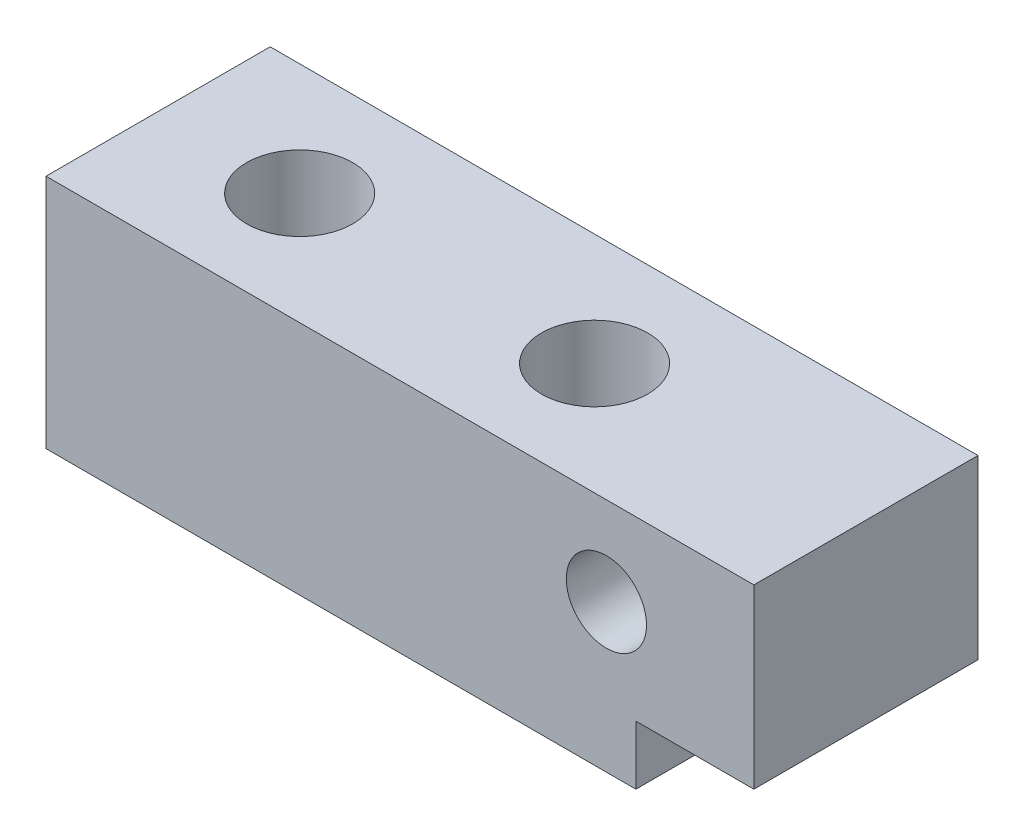
ISO-10303-21;
HEADER;
FILE_DESCRIPTION(('STEP AP214'),'2;1');
FILE_NAME('part.step','',(''),(''),'','','');
FILE_SCHEMA(('AUTOMOTIVE_DESIGN { 1 0 10303 214 1 1 1 1 }'));
ENDSEC;
DATA;
#1=APPLICATION_CONTEXT('core data for automotive mechanical design processes');
#2=APPLICATION_PROTOCOL_DEFINITION('international standard','automotive_design',2000,#1);
#3=PRODUCT_CONTEXT('',#1,'mechanical');
#4=PRODUCT('Part','Part','',(#3));
#5=PRODUCT_RELATED_PRODUCT_CATEGORY('part','',(#4));
#6=PRODUCT_DEFINITION_FORMATION('','',#4);
#7=PRODUCT_DEFINITION_CONTEXT('part definition',#1,'design');
#8=PRODUCT_DEFINITION('design','',#6,#7);
#9=PRODUCT_DEFINITION_SHAPE('','',#8);
#10=(LENGTH_UNIT() NAMED_UNIT(*) SI_UNIT(.MILLI.,.METRE.));
#11=(NAMED_UNIT(*) PLANE_ANGLE_UNIT() SI_UNIT($,.RADIAN.));
#12=(NAMED_UNIT(*) SI_UNIT($,.STERADIAN.) SOLID_ANGLE_UNIT());
#13=UNCERTAINTY_MEASURE_WITH_UNIT(LENGTH_MEASURE(1.E-05),#10,'distance_accuracy_value','');
#14=(GEOMETRIC_REPRESENTATION_CONTEXT(3) GLOBAL_UNCERTAINTY_ASSIGNED_CONTEXT((#13)) GLOBAL_UNIT_ASSIGNED_CONTEXT((#10,
#11,#12)) REPRESENTATION_CONTEXT('',''));
#15=CARTESIAN_POINT('',(0.,0.,0.));
#16=DIRECTION('',(0.,0.,1.));
#17=DIRECTION('',(1.,0.,0.));
#18=AXIS2_PLACEMENT_3D('',#15,#16,#17);
#19=CARTESIAN_POINT('',(0.,0.,-9.5));
#20=DIRECTION('',(-1.,0.,0.));
#21=DIRECTION('',(0.,0.,1.));
#22=AXIS2_PLACEMENT_3D('',#19,#20,#21);
#23=PLANE('',#22);
#24=DIRECTION('',(0.,-1.,0.));
#25=VECTOR('',#24,1.);
#26=CARTESIAN_POINT('',(0.,0.,9.5));
#27=LINE('',#26,#25);
#28=CARTESIAN_POINT('',(0.,20.,9.5));
#29=VERTEX_POINT('',#28);
#30=CARTESIAN_POINT('',(0.,0.,9.5));
#31=VERTEX_POINT('',#30);
#32=EDGE_CURVE('E124',#29,#31,#27,.T.);
#33=ORIENTED_EDGE('',*,*,#32,.F.);
#34=DIRECTION('',(0.,0.,1.));
#35=VECTOR('',#34,1.);
#36=CARTESIAN_POINT('',(0.,20.,-9.5));
#37=LINE('',#36,#35);
#38=CARTESIAN_POINT('',(0.,20.,-9.5));
#39=VERTEX_POINT('',#38);
#40=EDGE_CURVE('E11',#39,#29,#37,.T.);
#41=ORIENTED_EDGE('',*,*,#40,.F.);
#42=DIRECTION('',(0.,-1.,0.));
#43=VECTOR('',#42,1.);
#44=CARTESIAN_POINT('',(0.,0.,-9.5));
#45=LINE('',#44,#43);
#46=CARTESIAN_POINT('',(0.,0.,-9.5));
#47=VERTEX_POINT('',#46);
#48=EDGE_CURVE('E120',#39,#47,#45,.T.);
#49=ORIENTED_EDGE('',*,*,#48,.T.);
#50=DIRECTION('',(0.,0.,1.));
#51=VECTOR('',#50,1.);
#52=CARTESIAN_POINT('',(0.,0.,-9.5));
#53=LINE('',#52,#51);
#54=EDGE_CURVE('E39',#47,#31,#53,.T.);
#55=ORIENTED_EDGE('',*,*,#54,.T.);
#56=EDGE_LOOP('',(#33,#41,#49,#55));
#57=FACE_BOUND('',#56,.T.);
#58=ADVANCED_FACE('F36',(#57),#23,.T.);
#59=CARTESIAN_POINT('',(0.,20.,-9.5));
#60=DIRECTION('',(0.,1.,0.));
#61=DIRECTION('',(-1.,0.,0.));
#62=AXIS2_PLACEMENT_3D('',#59,#60,#61);
#63=PLANE('',#62);
#64=CARTESIAN_POINT('',(12.,20.,0.));
#65=DIRECTION('',(0.,1.,0.));
#66=DIRECTION('',(0.,0.,1.));
#67=AXIS2_PLACEMENT_3D('',#64,#65,#66);
#68=CIRCLE('',#67,4.49999999999999);
#69=CARTESIAN_POINT('',(12.,20.,4.49999999999999));
#70=VERTEX_POINT('',#69);
#71=EDGE_CURVE('E212',#70,#70,#68,.T.);
#72=ORIENTED_EDGE('',*,*,#71,.F.);
#73=EDGE_LOOP('',(#72));
#74=FACE_BOUND('',#73,.T.);
#75=CARTESIAN_POINT('',(37.,20.,0.));
#76=DIRECTION('',(0.,1.,0.));
#77=DIRECTION('',(0.,0.,1.));
#78=AXIS2_PLACEMENT_3D('',#75,#76,#77);
#79=CIRCLE('',#78,4.49999999999999);
#80=CARTESIAN_POINT('',(37.,20.,4.49999999999999));
#81=VERTEX_POINT('',#80);
#82=EDGE_CURVE('E168',#81,#81,#79,.T.);
#83=ORIENTED_EDGE('',*,*,#82,.F.);
#84=EDGE_LOOP('',(#83));
#85=FACE_BOUND('',#84,.T.);
#86=DIRECTION('',(-1.,0.,0.));
#87=VECTOR('',#86,1.);
#88=CARTESIAN_POINT('',(0.,20.,9.5));
#89=LINE('',#88,#87);
#90=CARTESIAN_POINT('',(60.,20.,9.5));
#91=VERTEX_POINT('',#90);
#92=EDGE_CURVE('E133',#91,#29,#89,.T.);
#93=ORIENTED_EDGE('',*,*,#92,.F.);
#94=DIRECTION('',(0.,0.,1.));
#95=VECTOR('',#94,1.);
#96=CARTESIAN_POINT('',(60.,20.,-9.5));
#97=LINE('',#96,#95);
#98=CARTESIAN_POINT('',(60.,20.,-9.5));
#99=VERTEX_POINT('',#98);
#100=EDGE_CURVE('E44',#99,#91,#97,.T.);
#101=ORIENTED_EDGE('',*,*,#100,.F.);
#102=DIRECTION('',(-1.,0.,0.));
#103=VECTOR('',#102,1.);
#104=CARTESIAN_POINT('',(0.,20.,-9.5));
#105=LINE('',#104,#103);
#106=EDGE_CURVE('E115',#99,#39,#105,.T.);
#107=ORIENTED_EDGE('',*,*,#106,.T.);
#108=ORIENTED_EDGE('',*,*,#40,.T.);
#109=EDGE_LOOP('',(#93,#101,#107,#108));
#110=FACE_BOUND('',#109,.T.);
#111=ADVANCED_FACE('F140',(#74,#85,#110),#63,.T.);
#112=CARTESIAN_POINT('',(60.,0.,-9.5));
#113=DIRECTION('',(1.,0.,0.));
#114=DIRECTION('',(0.,0.,-1.));
#115=AXIS2_PLACEMENT_3D('',#112,#113,#114);
#116=PLANE('',#115);
#117=DIRECTION('',(0.,0.,1.));
#118=VECTOR('',#117,1.);
#119=CARTESIAN_POINT('',(60.,5.,-9.5));
#120=LINE('',#119,#118);
#121=CARTESIAN_POINT('',(60.,5.,-9.5));
#122=VERTEX_POINT('',#121);
#123=CARTESIAN_POINT('',(60.,5.,9.5));
#124=VERTEX_POINT('',#123);
#125=EDGE_CURVE('E52',#122,#124,#120,.T.);
#126=ORIENTED_EDGE('',*,*,#125,.F.);
#127=DIRECTION('',(0.,1.,0.));
#128=VECTOR('',#127,1.);
#129=CARTESIAN_POINT('',(60.,0.,-9.5));
#130=LINE('',#129,#128);
#131=EDGE_CURVE('E109',#122,#99,#130,.T.);
#132=ORIENTED_EDGE('',*,*,#131,.T.);
#133=ORIENTED_EDGE('',*,*,#100,.T.);
#134=DIRECTION('',(0.,1.,0.));
#135=VECTOR('',#134,1.);
#136=CARTESIAN_POINT('',(60.,0.,9.5));
#137=LINE('',#136,#135);
#138=EDGE_CURVE('E111',#124,#91,#137,.T.);
#139=ORIENTED_EDGE('',*,*,#138,.F.);
#140=EDGE_LOOP('',(#126,#132,#133,#139));
#141=FACE_BOUND('',#140,.T.);
#142=ADVANCED_FACE('F107',(#141),#116,.T.);
#143=CARTESIAN_POINT('',(0.,0.,-9.5));
#144=DIRECTION('',(0.,-1.,0.));
#145=DIRECTION('',(0.,0.,-1.));
#146=AXIS2_PLACEMENT_3D('',#143,#144,#145);
#147=PLANE('',#146);
#148=CARTESIAN_POINT('',(12.,0.,0.));
#149=DIRECTION('',(0.,1.,0.));
#150=DIRECTION('',(0.,0.,1.));
#151=AXIS2_PLACEMENT_3D('',#148,#149,#150);
#152=CIRCLE('',#151,4.5);
#153=CARTESIAN_POINT('',(12.,0.,4.5));
#154=VERTEX_POINT('',#153);
#155=EDGE_CURVE('E162',#154,#154,#152,.T.);
#156=ORIENTED_EDGE('',*,*,#155,.T.);
#157=EDGE_LOOP('',(#156));
#158=FACE_BOUND('',#157,.T.);
#159=CARTESIAN_POINT('',(37.,0.,0.));
#160=DIRECTION('',(0.,1.,0.));
#161=DIRECTION('',(0.,0.,1.));
#162=AXIS2_PLACEMENT_3D('',#159,#160,#161);
#163=CIRCLE('',#162,4.5);
#164=CARTESIAN_POINT('',(37.,0.,4.5));
#165=VERTEX_POINT('',#164);
#166=EDGE_CURVE('E165',#165,#165,#163,.T.);
#167=ORIENTED_EDGE('',*,*,#166,.T.);
#168=EDGE_LOOP('',(#167));
#169=FACE_BOUND('',#168,.T.);
#170=DIRECTION('',(0.,0.,1.));
#171=VECTOR('',#170,1.);
#172=CARTESIAN_POINT('',(50.,0.,-9.5));
#173=LINE('',#172,#171);
#174=CARTESIAN_POINT('',(50.,0.,-9.5));
#175=VERTEX_POINT('',#174);
#176=CARTESIAN_POINT('',(50.,0.,9.5));
#177=VERTEX_POINT('',#176);
#178=EDGE_CURVE('E128',#175,#177,#173,.T.);
#179=ORIENTED_EDGE('',*,*,#178,.T.);
#180=DIRECTION('',(1.,0.,0.));
#181=VECTOR('',#180,1.);
#182=CARTESIAN_POINT('',(0.,0.,9.5));
#183=LINE('',#182,#181);
#184=EDGE_CURVE('E127',#31,#177,#183,.T.);
#185=ORIENTED_EDGE('',*,*,#184,.F.);
#186=ORIENTED_EDGE('',*,*,#54,.F.);
#187=DIRECTION('',(1.,0.,0.));
#188=VECTOR('',#187,1.);
#189=CARTESIAN_POINT('',(0.,0.,-9.5));
#190=LINE('',#189,#188);
#191=EDGE_CURVE('E116',#47,#175,#190,.T.);
#192=ORIENTED_EDGE('',*,*,#191,.T.);
#193=EDGE_LOOP('',(#179,#185,#186,#192));
#194=FACE_BOUND('',#193,.T.);
#195=ADVANCED_FACE('F136',(#158,#169,#194),#147,.T.);
#196=CARTESIAN_POINT('',(0.,20.,-9.5));
#197=DIRECTION('',(0.,0.,-1.));
#198=DIRECTION('',(-1.,0.,0.));
#199=AXIS2_PLACEMENT_3D('',#196,#197,#198);
#200=PLANE('',#199);
#201=CARTESIAN_POINT('',(47.5,12.5,-9.5));
#202=DIRECTION('',(0.,0.,1.));
#203=DIRECTION('',(1.,0.,0.));
#204=AXIS2_PLACEMENT_3D('',#201,#202,#203);
#205=CIRCLE('',#204,3.39999999999999);
#206=CARTESIAN_POINT('',(50.9,12.5,-9.5));
#207=VERTEX_POINT('',#206);
#208=EDGE_CURVE('E205',#207,#207,#205,.T.);
#209=ORIENTED_EDGE('',*,*,#208,.T.);
#210=EDGE_LOOP('',(#209));
#211=FACE_BOUND('',#210,.T.);
#212=DIRECTION('',(0.,-1.,0.));
#213=VECTOR('',#212,1.);
#214=CARTESIAN_POINT('',(50.,0.,-9.5));
#215=LINE('',#214,#213);
#216=CARTESIAN_POINT('',(50.,5.,-9.5));
#217=VERTEX_POINT('',#216);
#218=EDGE_CURVE('E102',#217,#175,#215,.T.);
#219=ORIENTED_EDGE('',*,*,#218,.T.);
#220=ORIENTED_EDGE('',*,*,#191,.F.);
#221=ORIENTED_EDGE('',*,*,#48,.F.);
#222=ORIENTED_EDGE('',*,*,#106,.F.);
#223=ORIENTED_EDGE('',*,*,#131,.F.);
#224=DIRECTION('',(-1.,0.,0.));
#225=VECTOR('',#224,1.);
#226=CARTESIAN_POINT('',(60.,5.,-9.5));
#227=LINE('',#226,#225);
#228=EDGE_CURVE('E95',#122,#217,#227,.T.);
#229=ORIENTED_EDGE('',*,*,#228,.T.);
#230=EDGE_LOOP('',(#219,#220,#221,#222,#223,#229));
#231=FACE_BOUND('',#230,.T.);
#232=ADVANCED_FACE('F114',(#211,#231),#200,.T.);
#233=CARTESIAN_POINT('',(0.,20.,9.5));
#234=DIRECTION('',(0.,0.,-1.));
#235=DIRECTION('',(-1.,0.,0.));
#236=AXIS2_PLACEMENT_3D('',#233,#234,#235);
#237=PLANE('',#236);
#238=CARTESIAN_POINT('',(47.5,12.5,9.5));
#239=DIRECTION('',(0.,0.,1.));
#240=DIRECTION('',(1.,0.,0.));
#241=AXIS2_PLACEMENT_3D('',#238,#239,#240);
#242=CIRCLE('',#241,3.39999999999999);
#243=CARTESIAN_POINT('',(50.9,12.5,9.5));
#244=VERTEX_POINT('',#243);
#245=EDGE_CURVE('E208',#244,#244,#242,.T.);
#246=ORIENTED_EDGE('',*,*,#245,.F.);
#247=EDGE_LOOP('',(#246));
#248=FACE_BOUND('',#247,.T.);
#249=ORIENTED_EDGE('',*,*,#184,.T.);
#250=DIRECTION('',(0.,-1.,0.));
#251=VECTOR('',#250,1.);
#252=CARTESIAN_POINT('',(50.,0.,9.5));
#253=LINE('',#252,#251);
#254=CARTESIAN_POINT('',(50.,5.,9.5));
#255=VERTEX_POINT('',#254);
#256=EDGE_CURVE('E103',#255,#177,#253,.T.);
#257=ORIENTED_EDGE('',*,*,#256,.F.);
#258=DIRECTION('',(-1.,0.,0.));
#259=VECTOR('',#258,1.);
#260=CARTESIAN_POINT('',(60.,5.,9.5));
#261=LINE('',#260,#259);
#262=EDGE_CURVE('E167',#124,#255,#261,.T.);
#263=ORIENTED_EDGE('',*,*,#262,.F.);
#264=ORIENTED_EDGE('',*,*,#138,.T.);
#265=ORIENTED_EDGE('',*,*,#92,.T.);
#266=ORIENTED_EDGE('',*,*,#32,.T.);
#267=EDGE_LOOP('',(#249,#257,#263,#264,#265,#266));
#268=FACE_BOUND('',#267,.T.);
#269=ADVANCED_FACE('F139',(#248,#268),#237,.F.);
#270=CARTESIAN_POINT('',(50.,0.,-9.5));
#271=DIRECTION('',(-1.,0.,0.));
#272=DIRECTION('',(0.,0.,1.));
#273=AXIS2_PLACEMENT_3D('',#270,#271,#272);
#274=PLANE('',#273);
#275=ORIENTED_EDGE('',*,*,#256,.T.);
#276=ORIENTED_EDGE('',*,*,#178,.F.);
#277=ORIENTED_EDGE('',*,*,#218,.F.);
#278=DIRECTION('',(0.,0.,1.));
#279=VECTOR('',#278,1.);
#280=CARTESIAN_POINT('',(50.,5.,-9.5));
#281=LINE('',#280,#279);
#282=EDGE_CURVE('E97',#217,#255,#281,.T.);
#283=ORIENTED_EDGE('',*,*,#282,.T.);
#284=EDGE_LOOP('',(#275,#276,#277,#283));
#285=FACE_BOUND('',#284,.T.);
#286=ADVANCED_FACE('F180',(#285),#274,.F.);
#287=CARTESIAN_POINT('',(60.,5.,-9.5));
#288=DIRECTION('',(0.,1.,0.));
#289=DIRECTION('',(-1.,0.,0.));
#290=AXIS2_PLACEMENT_3D('',#287,#288,#289);
#291=PLANE('',#290);
#292=ORIENTED_EDGE('',*,*,#262,.T.);
#293=ORIENTED_EDGE('',*,*,#282,.F.);
#294=ORIENTED_EDGE('',*,*,#228,.F.);
#295=ORIENTED_EDGE('',*,*,#125,.T.);
#296=EDGE_LOOP('',(#292,#293,#294,#295));
#297=FACE_BOUND('',#296,.T.);
#298=ADVANCED_FACE('F96',(#297),#291,.F.);
#299=CARTESIAN_POINT('',(37.,20.,0.));
#300=DIRECTION('',(0.,1.,0.));
#301=DIRECTION('',(0.,0.,1.));
#302=AXIS2_PLACEMENT_3D('',#299,#300,#301);
#303=CYLINDRICAL_SURFACE('',#302,4.49999999999999);
#304=ORIENTED_EDGE('',*,*,#166,.F.);
#305=EDGE_LOOP('',(#304));
#306=FACE_BOUND('',#305,.T.);
#307=ORIENTED_EDGE('',*,*,#82,.T.);
#308=EDGE_LOOP('',(#307));
#309=FACE_BOUND('',#308,.T.);
#310=ADVANCED_FACE('F187',(#306,#309),#303,.F.);
#311=CARTESIAN_POINT('',(12.,20.,0.));
#312=DIRECTION('',(0.,1.,0.));
#313=DIRECTION('',(0.,0.,1.));
#314=AXIS2_PLACEMENT_3D('',#311,#312,#313);
#315=CYLINDRICAL_SURFACE('',#314,4.49999999999999);
#316=ORIENTED_EDGE('',*,*,#155,.F.);
#317=EDGE_LOOP('',(#316));
#318=FACE_BOUND('',#317,.T.);
#319=ORIENTED_EDGE('',*,*,#71,.T.);
#320=EDGE_LOOP('',(#319));
#321=FACE_BOUND('',#320,.T.);
#322=ADVANCED_FACE('F193',(#318,#321),#315,.F.);
#323=CARTESIAN_POINT('',(47.5,12.5,9.5));
#324=DIRECTION('',(0.,0.,1.));
#325=DIRECTION('',(1.,0.,0.));
#326=AXIS2_PLACEMENT_3D('',#323,#324,#325);
#327=CYLINDRICAL_SURFACE('',#326,3.39999999999999);
#328=ORIENTED_EDGE('',*,*,#208,.F.);
#329=EDGE_LOOP('',(#328));
#330=FACE_BOUND('',#329,.T.);
#331=ORIENTED_EDGE('',*,*,#245,.T.);
#332=EDGE_LOOP('',(#331));
#333=FACE_BOUND('',#332,.T.);
#334=ADVANCED_FACE('F196',(#330,#333),#327,.F.);
#335=CLOSED_SHELL('',(#58,#111,#142,#195,#232,#269,#286,#298,#310,#322,#334));
#336=MANIFOLD_SOLID_BREP('B2',#335);
#337=ADVANCED_BREP_SHAPE_REPRESENTATION('',(#18,#336),#14);
#338=SHAPE_DEFINITION_REPRESENTATION(#9,#337);
ENDSEC;
END-ISO-10303-21;
